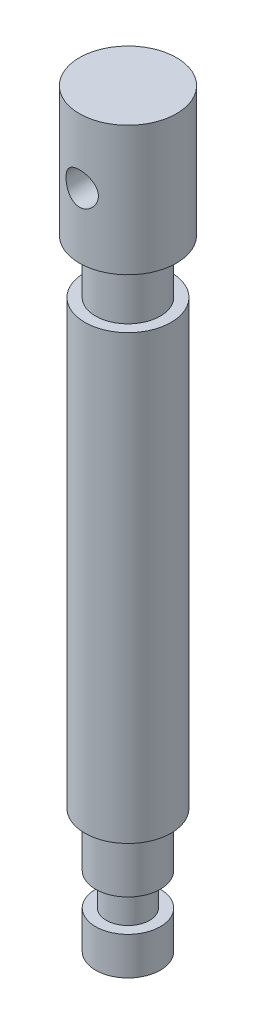
ISO-10303-21;
HEADER;
FILE_DESCRIPTION(('STEP AP214'),'2;1');
FILE_NAME('part.step','',(''),(''),'','','');
FILE_SCHEMA(('AUTOMOTIVE_DESIGN { 1 0 10303 214 1 1 1 1 }'));
ENDSEC;
DATA;
#1=APPLICATION_CONTEXT('core data for automotive mechanical design processes');
#2=APPLICATION_PROTOCOL_DEFINITION('international standard','automotive_design',2000,#1);
#3=PRODUCT_CONTEXT('',#1,'mechanical');
#4=PRODUCT('Part','Part','',(#3));
#5=PRODUCT_RELATED_PRODUCT_CATEGORY('part','',(#4));
#6=PRODUCT_DEFINITION_FORMATION('','',#4);
#7=PRODUCT_DEFINITION_CONTEXT('part definition',#1,'design');
#8=PRODUCT_DEFINITION('design','',#6,#7);
#9=PRODUCT_DEFINITION_SHAPE('','',#8);
#10=(LENGTH_UNIT() NAMED_UNIT(*) SI_UNIT(.MILLI.,.METRE.));
#11=(NAMED_UNIT(*) PLANE_ANGLE_UNIT() SI_UNIT($,.RADIAN.));
#12=(NAMED_UNIT(*) SI_UNIT($,.STERADIAN.) SOLID_ANGLE_UNIT());
#13=UNCERTAINTY_MEASURE_WITH_UNIT(LENGTH_MEASURE(1.E-05),#10,'distance_accuracy_value','');
#14=(GEOMETRIC_REPRESENTATION_CONTEXT(3) GLOBAL_UNCERTAINTY_ASSIGNED_CONTEXT((#13)) GLOBAL_UNIT_ASSIGNED_CONTEXT((#10,
#11,#12)) REPRESENTATION_CONTEXT('',''));
#15=CARTESIAN_POINT('',(0.,0.,0.));
#16=DIRECTION('',(0.,0.,1.));
#17=DIRECTION('',(1.,0.,0.));
#18=AXIS2_PLACEMENT_3D('',#15,#16,#17);
#19=CARTESIAN_POINT('',(0.,82.,0.));
#20=DIRECTION('',(0.,-1.,0.));
#21=DIRECTION('',(0.,0.,-1.));
#22=AXIS2_PLACEMENT_3D('',#19,#20,#21);
#23=CYLINDRICAL_SURFACE('',#22,8.);
#24=CARTESIAN_POINT('',(0.,82.,0.));
#25=DIRECTION('',(0.,1.,0.));
#26=DIRECTION('',(0.,0.,1.));
#27=AXIS2_PLACEMENT_3D('',#24,#25,#26);
#28=CIRCLE('',#27,8.);
#29=CARTESIAN_POINT('',(0.,82.,8.));
#30=VERTEX_POINT('',#29);
#31=EDGE_CURVE('E114',#30,#30,#28,.T.);
#32=ORIENTED_EDGE('',*,*,#31,.F.);
#33=EDGE_LOOP('',(#32));
#34=FACE_BOUND('',#33,.T.);
#35=CARTESIAN_POINT('',(0.,0.,0.));
#36=DIRECTION('',(0.,1.,0.));
#37=DIRECTION('',(0.,0.,1.));
#38=AXIS2_PLACEMENT_3D('',#35,#36,#37);
#39=CIRCLE('',#38,8.);
#40=CARTESIAN_POINT('',(0.,0.,8.));
#41=VERTEX_POINT('',#40);
#42=EDGE_CURVE('E56',#41,#41,#39,.T.);
#43=ORIENTED_EDGE('',*,*,#42,.T.);
#44=EDGE_LOOP('',(#43));
#45=FACE_BOUND('',#44,.T.);
#46=ADVANCED_FACE('F31',(#34,#45),#23,.T.);
#47=CARTESIAN_POINT('',(0.,82.,0.));
#48=DIRECTION('',(0.,1.,0.));
#49=DIRECTION('',(0.,0.,1.));
#50=AXIS2_PLACEMENT_3D('',#47,#48,#49);
#51=PLANE('',#50);
#52=CARTESIAN_POINT('',(0.,82.,0.));
#53=DIRECTION('',(0.,1.,0.));
#54=DIRECTION('',(0.,0.,1.));
#55=AXIS2_PLACEMENT_3D('',#52,#53,#54);
#56=CIRCLE('',#55,6.);
#57=CARTESIAN_POINT('',(0.,82.,6.));
#58=VERTEX_POINT('',#57);
#59=EDGE_CURVE('E119',#58,#58,#56,.T.);
#60=ORIENTED_EDGE('',*,*,#59,.F.);
#61=EDGE_LOOP('',(#60));
#62=FACE_BOUND('',#61,.T.);
#63=ORIENTED_EDGE('',*,*,#31,.T.);
#64=EDGE_LOOP('',(#63));
#65=FACE_BOUND('',#64,.T.);
#66=ADVANCED_FACE('F103',(#62,#65),#51,.T.);
#67=CARTESIAN_POINT('',(0.,0.,0.));
#68=DIRECTION('',(0.,1.,0.));
#69=DIRECTION('',(0.,0.,1.));
#70=AXIS2_PLACEMENT_3D('',#67,#68,#69);
#71=PLANE('',#70);
#72=CARTESIAN_POINT('',(0.,0.,0.));
#73=DIRECTION('',(0.,-1.,0.));
#74=DIRECTION('',(0.,0.,-1.));
#75=AXIS2_PLACEMENT_3D('',#72,#73,#74);
#76=CIRCLE('',#75,6.);
#77=CARTESIAN_POINT('',(0.,0.,-6.));
#78=VERTEX_POINT('',#77);
#79=EDGE_CURVE('E50',#78,#78,#76,.T.);
#80=ORIENTED_EDGE('',*,*,#79,.F.);
#81=EDGE_LOOP('',(#80));
#82=FACE_BOUND('',#81,.T.);
#83=ORIENTED_EDGE('',*,*,#42,.F.);
#84=EDGE_LOOP('',(#83));
#85=FACE_BOUND('',#84,.T.);
#86=ADVANCED_FACE('F108',(#82,#85),#71,.F.);
#87=CARTESIAN_POINT('',(0.,92.,0.));
#88=DIRECTION('',(0.,-1.,0.));
#89=DIRECTION('',(0.,0.,-1.));
#90=AXIS2_PLACEMENT_3D('',#87,#88,#89);
#91=CYLINDRICAL_SURFACE('',#90,6.);
#92=CARTESIAN_POINT('',(0.,92.,0.));
#93=DIRECTION('',(0.,1.,0.));
#94=DIRECTION('',(0.,0.,1.));
#95=AXIS2_PLACEMENT_3D('',#92,#93,#94);
#96=CIRCLE('',#95,6.);
#97=CARTESIAN_POINT('',(0.,92.,6.));
#98=VERTEX_POINT('',#97);
#99=EDGE_CURVE('E118',#98,#98,#96,.T.);
#100=ORIENTED_EDGE('',*,*,#99,.F.);
#101=EDGE_LOOP('',(#100));
#102=FACE_BOUND('',#101,.T.);
#103=ORIENTED_EDGE('',*,*,#59,.T.);
#104=EDGE_LOOP('',(#103));
#105=FACE_BOUND('',#104,.T.);
#106=ADVANCED_FACE('F160',(#102,#105),#91,.T.);
#107=CARTESIAN_POINT('',(0.,116.,0.));
#108=DIRECTION('',(0.,-1.,0.));
#109=DIRECTION('',(0.,0.,-1.));
#110=AXIS2_PLACEMENT_3D('',#107,#108,#109);
#111=CYLINDRICAL_SURFACE('',#110,9.);
#112=CARTESIAN_POINT('',(0.,107.,-9.));
#113=CARTESIAN_POINT('',(-0.16369008866017,107.000000761195,-9.00000045902832));
#114=CARTESIAN_POINT('',(-0.32737558361565,106.986559201618,-8.99549308522634));
#115=CARTESIAN_POINT('',(-0.649925282618918,106.933312673548,-8.97795630609842));
#116=CARTESIAN_POINT('',(-0.808788984356455,106.893504968153,-8.96492601606458));
#117=CARTESIAN_POINT('',(-1.11699836850533,106.789042269848,-8.93175923719328));
#118=CARTESIAN_POINT('',(-1.26635947765811,106.724428812622,-8.9116346319256));
#119=CARTESIAN_POINT('',(-1.55212481041598,106.572376481485,-8.86633337152025));
#120=CARTESIAN_POINT('',(-1.68852647087612,106.484933104992,-8.84115572003334));
#121=CARTESIAN_POINT('',(-1.9492250250668,106.286522585424,-8.78742283329015));
#122=CARTESIAN_POINT('',(-2.07301110089493,106.174906297219,-8.75878669391354));
#123=CARTESIAN_POINT('',(-2.30049807810626,105.93269853588,-8.70180944349364));
#124=CARTESIAN_POINT('',(-2.40419455646839,105.802102895214,-8.67346839871647));
#125=CARTESIAN_POINT('',(-2.59147482668358,105.521044654411,-8.61939997431821));
#126=CARTESIAN_POINT('',(-2.6743945746631,105.370118780804,-8.59377117827064));
#127=CARTESIAN_POINT('',(-2.81345662163317,105.055471716624,-8.54925916255803));
#128=CARTESIAN_POINT('',(-2.8696070921603,104.891754448512,-8.53037388482237));
#129=CARTESIAN_POINT('',(-2.95162038452749,104.56198033551,-8.50233909808132));
#130=CARTESIAN_POINT('',(-2.97844034481531,104.396188374533,-8.49288287308834));
#131=CARTESIAN_POINT('',(-3.00402337000343,104.062208737532,-8.48386969888522));
#132=CARTESIAN_POINT('',(-3.00279510481416,103.894021817872,-8.4843096906819));
#133=CARTESIAN_POINT('',(-2.97305971111026,103.568190108668,-8.4947704502454));
#134=CARTESIAN_POINT('',(-2.94580173950098,103.410414791243,-8.50435247602599));
#135=CARTESIAN_POINT('',(-2.86681848854825,103.101819741179,-8.53129973173653));
#136=CARTESIAN_POINT('',(-2.81509027977561,102.951000843695,-8.54866589352323));
#137=CARTESIAN_POINT('',(-2.68781717418063,102.657761751226,-8.58953733393746));
#138=CARTESIAN_POINT('',(-2.61190214612178,102.515515923591,-8.61313697379352));
#139=CARTESIAN_POINT('',(-2.43866731890941,102.245387275161,-8.66377675727179));
#140=CARTESIAN_POINT('',(-2.34134133709201,102.1175086192,-8.69081789371391));
#141=CARTESIAN_POINT('',(-2.12204799804671,101.872725205518,-8.74701987503223));
#142=CARTESIAN_POINT('',(-1.99905945022893,101.756741916473,-8.77621768064528));
#143=CARTESIAN_POINT('',(-1.73501870991019,101.54680620001,-8.8322081516111));
#144=CARTESIAN_POINT('',(-1.59396478698244,101.452855885506,-8.85900058614202));
#145=CARTESIAN_POINT('',(-1.2958428391388,101.288911099295,-8.90751323813381));
#146=CARTESIAN_POINT('',(-1.13862982924901,101.219163525978,-8.92918050024118));
#147=CARTESIAN_POINT('',(-0.813807250093527,101.107390478133,-8.96461701433304));
#148=CARTESIAN_POINT('',(-0.646201314464863,101.06535537373,-8.97838900964638));
#149=CARTESIAN_POINT('',(-0.313151488587911,101.011833001933,-8.99602881214321));
#150=CARTESIAN_POINT('',(-0.147928799594538,100.999100572482,-9.00030005501184));
#151=CARTESIAN_POINT('',(0.182325209880713,101.000998020795,-8.99966708084482));
#152=CARTESIAN_POINT('',(0.347356557958953,101.01562327994,-8.99476441258087));
#153=CARTESIAN_POINT('',(0.66755959891277,101.070835723208,-8.97660074151313));
#154=CARTESIAN_POINT('',(0.822878420504534,101.110658618148,-8.96358596133577));
#155=CARTESIAN_POINT('',(1.12456787573872,101.2141803334,-8.9307554049021));
#156=CARTESIAN_POINT('',(1.27093736552582,101.277882198403,-8.91093876140025));
#157=CARTESIAN_POINT('',(1.55486488917982,101.429211295522,-8.86586793861869));
#158=CARTESIAN_POINT('',(1.69208987765144,101.51742377985,-8.84048444267358));
#159=CARTESIAN_POINT('',(1.95019449040676,101.71458245004,-8.78715761748787));
#160=CARTESIAN_POINT('',(2.07106910338673,101.823534968095,-8.75921350781483));
#161=CARTESIAN_POINT('',(2.2987575234189,102.06493625302,-8.70230543941334));
#162=CARTESIAN_POINT('',(2.40468290773731,102.198227680781,-8.67335283262284));
#163=CARTESIAN_POINT('',(2.59277256697073,102.481314703433,-8.61899919884126));
#164=CARTESIAN_POINT('',(2.67493664379304,102.631110435902,-8.59359820146007));
#165=CARTESIAN_POINT('',(2.81279079124908,102.94301904587,-8.5494717537415));
#166=CARTESIAN_POINT('',(2.86853439649506,103.105106237506,-8.53073282378936));
#167=CARTESIAN_POINT('',(2.95168400027807,103.437135950132,-8.50232496919348));
#168=CARTESIAN_POINT('',(2.97910276486182,103.607074896213,-8.49265195870918));
#169=CARTESIAN_POINT('',(3.00382884743203,103.940591288123,-8.48393576622531));
#170=CARTESIAN_POINT('',(3.0026107719252,104.10404702086,-8.48437200772245));
#171=CARTESIAN_POINT('',(2.97372688034608,104.428295224766,-8.49453809471602));
#172=CARTESIAN_POINT('',(2.94606263837576,104.589087853865,-8.50426738708085));
#173=CARTESIAN_POINT('',(2.86611543938804,104.900406989007,-8.53153572914675));
#174=CARTESIAN_POINT('',(2.81431003804655,105.051070475013,-8.54892294067432));
#175=CARTESIAN_POINT('',(2.68793809727925,105.341682220815,-8.58949196455405));
#176=CARTESIAN_POINT('',(2.61336650566142,105.481628093564,-8.61267506290179));
#177=CARTESIAN_POINT('',(2.4397820777503,105.753451009769,-8.66348487678138));
#178=CARTESIAN_POINT('',(2.33984472829375,105.884709505695,-8.69126134926411));
#179=CARTESIAN_POINT('',(2.11992864940695,106.129069440153,-8.74750068849758));
#180=CARTESIAN_POINT('',(1.99994425335445,106.242165727064,-8.77596374737117));
#181=CARTESIAN_POINT('',(1.73772467076207,106.451433236868,-8.83170091576632));
#182=CARTESIAN_POINT('',(1.59480454049919,106.546773043253,-8.8588854540377));
#183=CARTESIAN_POINT('',(1.29407207221988,106.711971286552,-8.90777973517836));
#184=CARTESIAN_POINT('',(1.13626355439704,106.781836237766,-8.92949087723789));
#185=CARTESIAN_POINT('',(0.817480941602925,106.891164897466,-8.96416545205626));
#186=CARTESIAN_POINT('',(0.656963273029224,106.93184739879,-8.97747637267568));
#187=CARTESIAN_POINT('',(0.33096124803074,106.986260842031,-8.99539221192665));
#188=CARTESIAN_POINT('',(0.165478276706239,106.99999923049,-8.99999953595715));
#189=CARTESIAN_POINT('',(0.,107.,-9.));
#190=B_SPLINE_CURVE_WITH_KNOTS('',3,(#112,#113,#114,#115,#116,#117,#118,#119,#120,#121,#122,
#123,#124,#125,#126,#127,#128,#129,#130,#131,#132,#133,#134,#135,#136,#137,#138,#139,#140,#141,
#142,#143,#144,#145,#146,#147,#148,#149,#150,#151,#152,#153,#154,#155,#156,#157,#158,#159,#160,
#161,#162,#163,#164,#165,#166,#167,#168,#169,#170,#171,#172,#173,#174,#175,#176,#177,#178,#179,
#180,#181,#182,#183,#184,#185,#186,#187,#188,#189),.UNSPECIFIED.,.T.,.F.,(4,2,2,2,2,2,2,2,2,2,2,
2,2,2,2,2,2,2,2,2,2,2,2,2,2,2,2,2,2,2,2,2,2,2,2,2,2,2,4),(0.,0.490461318078034,
0.980973555802564,1.47066801861083,1.96045913339731,2.46554052848268,2.97073299862591,
3.49045154470412,4.010011340785,4.5120577722552,5.01394901962457,5.49290479653842,
5.97191792566448,6.45864513465393,6.94551307674622,7.45779917434102,7.97013437899856,
8.48755216951073,9.00479006631626,9.4996074952551,9.99434139492531,10.4747447393464,
10.9552093585231,11.4483119953121,11.9415654246567,12.4572306864226,12.9729002470499,
13.4875204148031,14.0019085411752,14.4898699819278,14.9778023805413,15.4564676124125,
15.9352391452793,16.4349020007541,16.9347063337134,17.453989825053,17.9731404345737,
18.4690967512144,18.9649159811442),.UNSPECIFIED.);
#191=CARTESIAN_POINT('',(0.,107.,-9.));
#192=VERTEX_POINT('',#191);
#193=EDGE_CURVE('E10',#192,#192,#190,.T.);
#194=ORIENTED_EDGE('',*,*,#193,.T.);
#195=EDGE_LOOP('',(#194));
#196=FACE_BOUND('',#195,.T.);
#197=CARTESIAN_POINT('',(3.,104.,8.48528137423857));
#198=CARTESIAN_POINT('',(3.00000077384314,103.836595475492,8.48528083591301));
#199=CARTESIAN_POINT('',(2.98660435105657,103.673195600529,8.49005307872572));
#200=CARTESIAN_POINT('',(2.93355339506643,103.351236737017,8.50852722243764));
#201=CARTESIAN_POINT('',(2.89389453650519,103.192678550383,8.52223059426566));
#202=CARTESIAN_POINT('',(2.78986645705471,102.885119321008,8.55684611066375));
#203=CARTESIAN_POINT('',(2.72554566420973,102.736100211672,8.57774411913966));
#204=CARTESIAN_POINT('',(2.57418488532413,102.450919854356,8.62437366030974));
#205=CARTESIAN_POINT('',(2.48713988658054,102.314761452339,8.65010625910837));
#206=CARTESIAN_POINT('',(2.28915343932863,102.053840112985,8.70463468222419));
#207=CARTESIAN_POINT('',(2.17747302413376,101.929653713985,8.73350684533932));
#208=CARTESIAN_POINT('',(1.93496300164319,101.701379596326,8.79041594403009));
#209=CARTESIAN_POINT('',(1.80413032515713,101.597295105253,8.81845274486885));
#210=CARTESIAN_POINT('',(1.52281352389503,101.409563308011,8.87141600765397));
#211=CARTESIAN_POINT('',(1.37190573367358,101.326520088146,8.89624223104816));
#212=CARTESIAN_POINT('',(1.05729366896243,101.187225244617,8.93908760312948));
#213=CARTESIAN_POINT('',(0.89359285706164,101.130966400469,8.95710858609006));
#214=CARTESIAN_POINT('',(0.564086452300487,101.048792436103,8.9837722629572));
#215=CARTESIAN_POINT('',(0.398552264558908,101.021889661229,8.99271944332677));
#216=CARTESIAN_POINT('',(0.0650936244722692,100.996051119918,9.00130824654744));
#217=CARTESIAN_POINT('',(-0.102830200631689,100.997108145043,9.00095226788686));
#218=CARTESIAN_POINT('',(-0.429310545581446,101.026532763698,8.99118118856194));
#219=CARTESIAN_POINT('',(-0.587976145774972,101.053827585423,8.98212194265352));
#220=CARTESIAN_POINT('',(-0.898330316466517,101.133178942941,8.95640902019194));
#221=CARTESIAN_POINT('',(-1.05001841333765,101.185237156939,8.93975482893545));
#222=CARTESIAN_POINT('',(-1.34445742452592,101.313263951918,8.90027010879673));
#223=CARTESIAN_POINT('',(-1.48706466290654,101.38953781564,8.87736127572046));
#224=CARTESIAN_POINT('',(-1.75777297658197,101.563579116346,8.82775179116757));
#225=CARTESIAN_POINT('',(-1.88587000315603,101.661352529983,8.801050086044));
#226=CARTESIAN_POINT('',(-2.13030259965392,101.881023180379,8.7451857554969));
#227=CARTESIAN_POINT('',(-2.24580047119581,102.003839473524,8.71596645506633));
#228=CARTESIAN_POINT('',(-2.45483177879452,102.26734617718,8.65942005746702));
#229=CARTESIAN_POINT('',(-2.54836182984463,102.408039337184,8.63209325236846));
#230=CARTESIAN_POINT('',(-2.71196236510723,102.70596087681,8.58211575363337));
#231=CARTESIAN_POINT('',(-2.78167939086402,102.863396393953,8.55953727854243));
#232=CARTESIAN_POINT('',(-2.89332957980801,103.188714182643,8.52244952473154));
#233=CARTESIAN_POINT('',(-2.93527438724248,103.356592043619,8.50793686461278));
#234=CARTESIAN_POINT('',(-2.98848384629257,103.689915066235,8.48938908946755));
#235=CARTESIAN_POINT('',(-3.0010472865229,103.855128274246,8.48491080956268));
#236=CARTESIAN_POINT('',(-2.99881631672916,104.185328447342,8.48570016177553));
#237=CARTESIAN_POINT('',(-2.98402687568029,104.350315448072,8.49096602375443));
#238=CARTESIAN_POINT('',(-2.92867695465693,104.669470897136,8.51020854270898));
#239=CARTESIAN_POINT('',(-2.88901918194205,104.823816290453,8.52387976322521));
#240=CARTESIAN_POINT('',(-2.7861415876814,105.123630818718,8.55805661013069));
#241=CARTESIAN_POINT('',(-2.72291758909027,105.269098374772,8.57856344804518));
#242=CARTESIAN_POINT('',(-2.57242302221681,105.552141262541,8.6249063278736));
#243=CARTESIAN_POINT('',(-2.48445335507549,105.689319927925,8.65089076996885));
#244=CARTESIAN_POINT('',(-2.28775689167267,105.947438157151,8.70497306192896));
#245=CARTESIAN_POINT('',(-2.17902397649635,106.068372915984,8.73307153331383));
#246=CARTESIAN_POINT('',(-1.93767511770098,106.296583952272,8.78985115913547));
#247=CARTESIAN_POINT('',(-1.80416181163995,106.402923170057,8.81849530733689));
#248=CARTESIAN_POINT('',(-1.52048187420077,106.591748427044,8.87180554839326));
#249=CARTESIAN_POINT('',(-1.37031583459366,106.674235313487,8.89647178253084));
#250=CARTESIAN_POINT('',(-1.05833958729689,106.812260314585,8.93893217431809));
#251=CARTESIAN_POINT('',(-0.89661336996359,106.867973831444,8.95677090013593));
#252=CARTESIAN_POINT('',(-0.565375397538048,106.95118322618,8.98375832513323));
#253=CARTESIAN_POINT('',(-0.395866475861668,106.978689289642,8.99291016102056));
#254=CARTESIAN_POINT('',(-0.0624460075801227,107.003786232817,9.00125589708769));
#255=CARTESIAN_POINT('',(0.101354171760056,107.002722361797,9.00089760268317));
#256=CARTESIAN_POINT('',(0.426333435000522,106.974028075561,8.99136589558194));
#257=CARTESIAN_POINT('',(0.58751273045717,106.946399815542,8.98219319800727));
#258=CARTESIAN_POINT('',(0.900126358296178,106.866253296272,8.95622744863237));
#259=CARTESIAN_POINT('',(1.05167481273837,106.814137353941,8.93955775083445));
#260=CARTESIAN_POINT('',(1.34393505281939,106.686867406709,8.90031482113485));
#261=CARTESIAN_POINT('',(1.4846448724273,106.611709234409,8.87774052144049));
#262=CARTESIAN_POINT('',(1.75690204892635,106.437291463694,8.82797606483643));
#263=CARTESIAN_POINT('',(1.88791875467281,106.337243943855,8.8006461747578));
#264=CARTESIAN_POINT('',(2.13174307881727,106.117227826531,8.74478966375639));
#265=CARTESIAN_POINT('',(2.24454486487377,105.997252873212,8.71626266319291));
#266=CARTESIAN_POINT('',(2.45322542649935,105.735171933239,8.65989839476794));
#267=CARTESIAN_POINT('',(2.5482688979937,105.59238346707,8.63213183965892));
#268=CARTESIAN_POINT('',(2.71294302990335,105.291996719292,8.58180579969046));
#269=CARTESIAN_POINT('',(2.78258033045843,105.134402320911,8.55924495483748));
#270=CARTESIAN_POINT('',(2.8915314846125,104.816114527953,8.52304002619544));
#271=CARTESIAN_POINT('',(2.93207372744856,104.655883209424,8.50903898571547));
#272=CARTESIAN_POINT('',(2.9863029604478,104.3304318486,8.49016150618554));
#273=CARTESIAN_POINT('',(2.99999921758978,104.165213547768,8.48528191852383));
#274=CARTESIAN_POINT('',(3.,104.,8.48528137423857));
#275=B_SPLINE_CURVE_WITH_KNOTS('',3,(#197,#198,#199,#200,#201,#202,#203,#204,#205,#206,#207,
#208,#209,#210,#211,#212,#213,#214,#215,#216,#217,#218,#219,#220,#221,#222,#223,#224,#225,#226,
#227,#228,#229,#230,#231,#232,#233,#234,#235,#236,#237,#238,#239,#240,#241,#242,#243,#244,#245,
#246,#247,#248,#249,#250,#251,#252,#253,#254,#255,#256,#257,#258,#259,#260,#261,#262,#263,#264,
#265,#266,#267,#268,#269,#270,#271,#272,#273,#274),.UNSPECIFIED.,.T.,.F.,(4,2,2,2,2,2,2,2,2,2,2,
2,2,2,2,2,2,2,2,2,2,2,2,2,2,2,2,2,2,2,2,2,2,2,2,2,2,2,4),(0.,0.489601754398076,
0.979284165045492,1.46800988250252,1.95684349855633,2.46304012282705,2.96931795515963,
3.48880518430971,4.00815229160367,4.50942956294803,5.01057759906982,5.49207014476707,
5.97359532567711,6.46144964581006,6.94943975622066,7.46040523091753,7.97144938836318,
8.48977919529167,9.00789154069849,9.5026287409332,9.99727607511702,10.4749318730633,
10.9526723744084,11.4455657320715,11.9386045698638,12.4553642451328,12.972105562726,
13.4854137357256,13.9985364901247,14.4875425403291,14.9765089202934,15.4577086812129,
15.9389955228973,16.438065585619,16.937295132979,17.4560670820843,17.974703348006,
18.4698963648807,18.9649184157139),.UNSPECIFIED.);
#276=CARTESIAN_POINT('',(3.,104.,8.48528137423857));
#277=VERTEX_POINT('',#276);
#278=EDGE_CURVE('E42',#277,#277,#275,.T.);
#279=ORIENTED_EDGE('',*,*,#278,.T.);
#280=EDGE_LOOP('',(#279));
#281=FACE_BOUND('',#280,.T.);
#282=CARTESIAN_POINT('',(0.,116.,0.));
#283=DIRECTION('',(0.,1.,0.));
#284=DIRECTION('',(0.,0.,1.));
#285=AXIS2_PLACEMENT_3D('',#282,#283,#284);
#286=CIRCLE('',#285,9.);
#287=CARTESIAN_POINT('',(0.,116.,9.));
#288=VERTEX_POINT('',#287);
#289=EDGE_CURVE('E120',#288,#288,#286,.T.);
#290=ORIENTED_EDGE('',*,*,#289,.F.);
#291=EDGE_LOOP('',(#290));
#292=FACE_BOUND('',#291,.T.);
#293=CARTESIAN_POINT('',(0.,92.,0.));
#294=DIRECTION('',(0.,1.,0.));
#295=DIRECTION('',(0.,0.,1.));
#296=AXIS2_PLACEMENT_3D('',#293,#294,#295);
#297=CIRCLE('',#296,9.);
#298=CARTESIAN_POINT('',(0.,92.,9.));
#299=VERTEX_POINT('',#298);
#300=EDGE_CURVE('E124',#299,#299,#297,.T.);
#301=ORIENTED_EDGE('',*,*,#300,.T.);
#302=EDGE_LOOP('',(#301));
#303=FACE_BOUND('',#302,.T.);
#304=ADVANCED_FACE('F58',(#196,#281,#292,#303),#111,.T.);
#305=CARTESIAN_POINT('',(0.,116.,0.));
#306=DIRECTION('',(0.,1.,0.));
#307=DIRECTION('',(0.,0.,1.));
#308=AXIS2_PLACEMENT_3D('',#305,#306,#307);
#309=PLANE('',#308);
#310=ORIENTED_EDGE('',*,*,#289,.T.);
#311=EDGE_LOOP('',(#310));
#312=FACE_BOUND('',#311,.T.);
#313=ADVANCED_FACE('F93',(#312),#309,.T.);
#314=CARTESIAN_POINT('',(0.,92.,0.));
#315=DIRECTION('',(0.,1.,0.));
#316=DIRECTION('',(0.,0.,1.));
#317=AXIS2_PLACEMENT_3D('',#314,#315,#316);
#318=PLANE('',#317);
#319=ORIENTED_EDGE('',*,*,#99,.T.);
#320=EDGE_LOOP('',(#319));
#321=FACE_BOUND('',#320,.T.);
#322=ORIENTED_EDGE('',*,*,#300,.F.);
#323=EDGE_LOOP('',(#322));
#324=FACE_BOUND('',#323,.T.);
#325=ADVANCED_FACE('F91',(#321,#324),#318,.F.);
#326=CARTESIAN_POINT('',(0.,-10.,0.));
#327=DIRECTION('',(0.,1.,0.));
#328=DIRECTION('',(0.,0.,1.));
#329=AXIS2_PLACEMENT_3D('',#326,#327,#328);
#330=CYLINDRICAL_SURFACE('',#329,6.);
#331=CARTESIAN_POINT('',(0.,-10.,0.));
#332=DIRECTION('',(0.,-1.,0.));
#333=DIRECTION('',(0.,0.,-1.));
#334=AXIS2_PLACEMENT_3D('',#331,#332,#333);
#335=CIRCLE('',#334,6.);
#336=CARTESIAN_POINT('',(0.,-10.,-6.));
#337=VERTEX_POINT('',#336);
#338=EDGE_CURVE('E136',#337,#337,#335,.T.);
#339=ORIENTED_EDGE('',*,*,#338,.F.);
#340=EDGE_LOOP('',(#339));
#341=FACE_BOUND('',#340,.T.);
#342=ORIENTED_EDGE('',*,*,#79,.T.);
#343=EDGE_LOOP('',(#342));
#344=FACE_BOUND('',#343,.T.);
#345=ADVANCED_FACE('F87',(#341,#344),#330,.T.);
#346=CARTESIAN_POINT('',(0.,-10.,0.));
#347=DIRECTION('',(0.,-1.,0.));
#348=DIRECTION('',(0.,0.,-1.));
#349=AXIS2_PLACEMENT_3D('',#346,#347,#348);
#350=PLANE('',#349);
#351=CARTESIAN_POINT('',(0.,-10.,0.));
#352=DIRECTION('',(0.,-1.,0.));
#353=DIRECTION('',(0.,0.,-1.));
#354=AXIS2_PLACEMENT_3D('',#351,#352,#353);
#355=CIRCLE('',#354,4.);
#356=CARTESIAN_POINT('',(0.,-10.,-4.));
#357=VERTEX_POINT('',#356);
#358=EDGE_CURVE('E46',#357,#357,#355,.T.);
#359=ORIENTED_EDGE('',*,*,#358,.F.);
#360=EDGE_LOOP('',(#359));
#361=FACE_BOUND('',#360,.T.);
#362=ORIENTED_EDGE('',*,*,#338,.T.);
#363=EDGE_LOOP('',(#362));
#364=FACE_BOUND('',#363,.T.);
#365=ADVANCED_FACE('F83',(#361,#364),#350,.T.);
#366=CARTESIAN_POINT('',(0.,-16.,0.));
#367=DIRECTION('',(0.,1.,0.));
#368=DIRECTION('',(0.,0.,1.));
#369=AXIS2_PLACEMENT_3D('',#366,#367,#368);
#370=CYLINDRICAL_SURFACE('',#369,4.);
#371=CARTESIAN_POINT('',(0.,-16.,0.));
#372=DIRECTION('',(0.,-1.,0.));
#373=DIRECTION('',(0.,0.,-1.));
#374=AXIS2_PLACEMENT_3D('',#371,#372,#373);
#375=CIRCLE('',#374,4.);
#376=CARTESIAN_POINT('',(0.,-16.,-4.));
#377=VERTEX_POINT('',#376);
#378=EDGE_CURVE('E138',#377,#377,#375,.T.);
#379=ORIENTED_EDGE('',*,*,#378,.F.);
#380=EDGE_LOOP('',(#379));
#381=FACE_BOUND('',#380,.T.);
#382=ORIENTED_EDGE('',*,*,#358,.T.);
#383=EDGE_LOOP('',(#382));
#384=FACE_BOUND('',#383,.T.);
#385=ADVANCED_FACE('F79',(#381,#384),#370,.T.);
#386=CARTESIAN_POINT('',(0.,-23.,0.));
#387=DIRECTION('',(0.,1.,0.));
#388=DIRECTION('',(0.,0.,1.));
#389=AXIS2_PLACEMENT_3D('',#386,#387,#388);
#390=CYLINDRICAL_SURFACE('',#389,6.);
#391=CARTESIAN_POINT('',(0.,-23.,0.));
#392=DIRECTION('',(0.,-1.,0.));
#393=DIRECTION('',(0.,0.,-1.));
#394=AXIS2_PLACEMENT_3D('',#391,#392,#393);
#395=CIRCLE('',#394,6.);
#396=CARTESIAN_POINT('',(0.,-23.,-6.));
#397=VERTEX_POINT('',#396);
#398=EDGE_CURVE('E142',#397,#397,#395,.T.);
#399=ORIENTED_EDGE('',*,*,#398,.F.);
#400=EDGE_LOOP('',(#399));
#401=FACE_BOUND('',#400,.T.);
#402=CARTESIAN_POINT('',(0.,-16.,0.));
#403=DIRECTION('',(0.,-1.,0.));
#404=DIRECTION('',(0.,0.,-1.));
#405=AXIS2_PLACEMENT_3D('',#402,#403,#404);
#406=CIRCLE('',#405,6.);
#407=CARTESIAN_POINT('',(0.,-16.,-6.));
#408=VERTEX_POINT('',#407);
#409=EDGE_CURVE('E143',#408,#408,#406,.T.);
#410=ORIENTED_EDGE('',*,*,#409,.T.);
#411=EDGE_LOOP('',(#410));
#412=FACE_BOUND('',#411,.T.);
#413=ADVANCED_FACE('F72',(#401,#412),#390,.T.);
#414=CARTESIAN_POINT('',(0.,-23.,0.));
#415=DIRECTION('',(0.,-1.,0.));
#416=DIRECTION('',(0.,0.,-1.));
#417=AXIS2_PLACEMENT_3D('',#414,#415,#416);
#418=PLANE('',#417);
#419=ORIENTED_EDGE('',*,*,#398,.T.);
#420=EDGE_LOOP('',(#419));
#421=FACE_BOUND('',#420,.T.);
#422=ADVANCED_FACE('F68',(#421),#418,.T.);
#423=CARTESIAN_POINT('',(0.,-16.,0.));
#424=DIRECTION('',(0.,-1.,0.));
#425=DIRECTION('',(0.,0.,-1.));
#426=AXIS2_PLACEMENT_3D('',#423,#424,#425);
#427=PLANE('',#426);
#428=ORIENTED_EDGE('',*,*,#378,.T.);
#429=EDGE_LOOP('',(#428));
#430=FACE_BOUND('',#429,.T.);
#431=ORIENTED_EDGE('',*,*,#409,.F.);
#432=EDGE_LOOP('',(#431));
#433=FACE_BOUND('',#432,.T.);
#434=ADVANCED_FACE('F66',(#430,#433),#427,.F.);
#435=CARTESIAN_POINT('',(0.,104.,-9.));
#436=DIRECTION('',(0.,0.,1.));
#437=DIRECTION('',(1.,0.,0.));
#438=AXIS2_PLACEMENT_3D('',#435,#436,#437);
#439=CYLINDRICAL_SURFACE('',#438,3.);
#440=ORIENTED_EDGE('',*,*,#278,.F.);
#441=EDGE_LOOP('',(#440));
#442=FACE_BOUND('',#441,.T.);
#443=ORIENTED_EDGE('',*,*,#193,.F.);
#444=EDGE_LOOP('',(#443));
#445=FACE_BOUND('',#444,.T.);
#446=ADVANCED_FACE('F62',(#442,#445),#439,.F.);
#447=CLOSED_SHELL('',(#46,#66,#86,#106,#304,#313,#325,#345,#365,#385,#413,#422,#434,#446));
#448=MANIFOLD_SOLID_BREP('B2',#447);
#449=ADVANCED_BREP_SHAPE_REPRESENTATION('',(#18,#448),#14);
#450=SHAPE_DEFINITION_REPRESENTATION(#9,#449);
ENDSEC;
END-ISO-10303-21;
